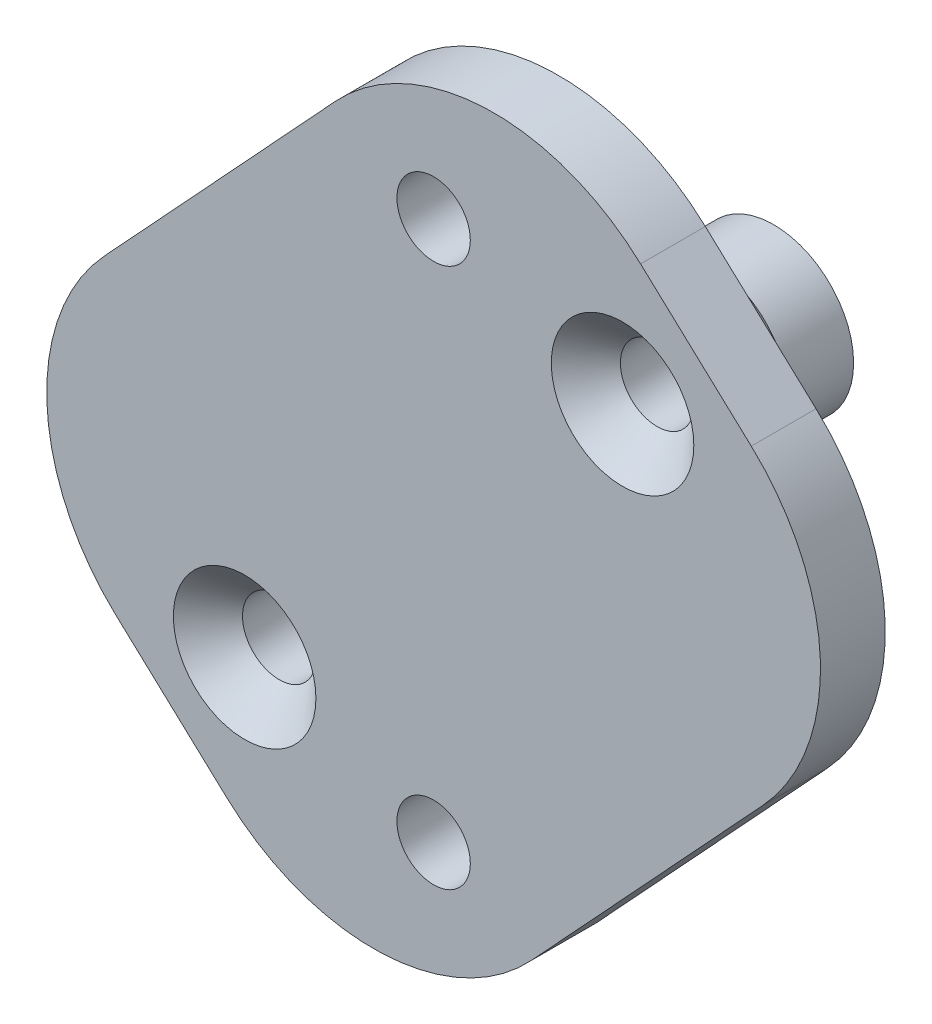
ISO-10303-21;
HEADER;
FILE_DESCRIPTION(('STEP AP214'),'2;1');
FILE_NAME('part.step','',(''),(''),'','','');
FILE_SCHEMA(('AUTOMOTIVE_DESIGN { 1 0 10303 214 1 1 1 1 }'));
ENDSEC;
DATA;
#1=APPLICATION_CONTEXT('core data for automotive mechanical design processes');
#2=APPLICATION_PROTOCOL_DEFINITION('international standard','automotive_design',2000,#1);
#3=PRODUCT_CONTEXT('',#1,'mechanical');
#4=PRODUCT('Part','Part','',(#3));
#5=PRODUCT_RELATED_PRODUCT_CATEGORY('part','',(#4));
#6=PRODUCT_DEFINITION_FORMATION('','',#4);
#7=PRODUCT_DEFINITION_CONTEXT('part definition',#1,'design');
#8=PRODUCT_DEFINITION('design','',#6,#7);
#9=PRODUCT_DEFINITION_SHAPE('','',#8);
#10=(LENGTH_UNIT() NAMED_UNIT(*) SI_UNIT(.MILLI.,.METRE.));
#11=(NAMED_UNIT(*) PLANE_ANGLE_UNIT() SI_UNIT($,.RADIAN.));
#12=(NAMED_UNIT(*) SI_UNIT($,.STERADIAN.) SOLID_ANGLE_UNIT());
#13=UNCERTAINTY_MEASURE_WITH_UNIT(LENGTH_MEASURE(1.E-05),#10,'distance_accuracy_value','');
#14=(GEOMETRIC_REPRESENTATION_CONTEXT(3) GLOBAL_UNCERTAINTY_ASSIGNED_CONTEXT((#13)) GLOBAL_UNIT_ASSIGNED_CONTEXT((#10,
#11,#12)) REPRESENTATION_CONTEXT('',''));
#15=CARTESIAN_POINT('',(0.,0.,0.));
#16=DIRECTION('',(0.,0.,1.));
#17=DIRECTION('',(1.,0.,0.));
#18=AXIS2_PLACEMENT_3D('',#15,#16,#17);
#19=CARTESIAN_POINT('',(0.,0.,1.5));
#20=DIRECTION('',(0.,0.,1.));
#21=DIRECTION('',(1.,0.,0.));
#22=AXIS2_PLACEMENT_3D('',#19,#20,#21);
#23=PLANE('',#22);
#24=CARTESIAN_POINT('',(-8.75,-9.45,1.5));
#25=DIRECTION('',(0.,0.,1.));
#26=DIRECTION('',(1.,0.,0.));
#27=AXIS2_PLACEMENT_3D('',#24,#25,#26);
#28=CIRCLE('',#27,3.3);
#29=CARTESIAN_POINT('',(-5.45,-9.45,1.5));
#30=VERTEX_POINT('',#29);
#31=EDGE_CURVE('E299',#30,#30,#28,.T.);
#32=ORIENTED_EDGE('',*,*,#31,.F.);
#33=EDGE_LOOP('',(#32));
#34=FACE_BOUND('',#33,.T.);
#35=CARTESIAN_POINT('',(8.75,9.45,1.5));
#36=DIRECTION('',(0.,0.,1.));
#37=DIRECTION('',(1.,0.,0.));
#38=AXIS2_PLACEMENT_3D('',#35,#36,#37);
#39=CIRCLE('',#38,3.3);
#40=CARTESIAN_POINT('',(12.05,9.45,1.5));
#41=VERTEX_POINT('',#40);
#42=EDGE_CURVE('E293',#41,#41,#39,.T.);
#43=ORIENTED_EDGE('',*,*,#42,.F.);
#44=EDGE_LOOP('',(#43));
#45=FACE_BOUND('',#44,.T.);
#46=CARTESIAN_POINT('',(0.,12.5,1.5));
#47=DIRECTION('',(0.,0.,1.));
#48=DIRECTION('',(1.,0.,0.));
#49=AXIS2_PLACEMENT_3D('',#46,#47,#48);
#50=CIRCLE('',#49,1.7);
#51=CARTESIAN_POINT('',(1.7,12.5,1.5));
#52=VERTEX_POINT('',#51);
#53=EDGE_CURVE('E263',#52,#52,#50,.T.);
#54=ORIENTED_EDGE('',*,*,#53,.F.);
#55=EDGE_LOOP('',(#54));
#56=FACE_BOUND('',#55,.T.);
#57=DIRECTION('',(0.679408031498305,0.73376067401817,0.));
#58=VECTOR('',#57,1.);
#59=CARTESIAN_POINT('',(-2.24670059833127,-22.2857844433874,1.5));
#60=LINE('',#59,#58);
#61=CARTESIAN_POINT('',(4.54737971665178,-14.9481777032057,1.5));
#62=VERTEX_POINT('',#61);
#63=CARTESIAN_POINT('',(15.2532994016688,-3.38578444338738,1.5));
#64=VERTEX_POINT('',#63);
#65=EDGE_CURVE('E255',#62,#64,#60,.T.);
#66=ORIENTED_EDGE('',*,*,#65,.T.);
#67=CARTESIAN_POINT('',(7.91569266148706,3.40829587159566,1.5));
#68=DIRECTION('',(0.,0.,1.));
#69=DIRECTION('',(1.,0.,0.));
#70=AXIS2_PLACEMENT_3D('',#67,#68,#69);
#71=CIRCLE('',#70,10.);
#72=CARTESIAN_POINT('',(14.7097729764701,10.7459026117774,1.5));
#73=VERTEX_POINT('',#72);
#74=EDGE_CURVE('E162',#64,#73,#71,.T.);
#75=ORIENTED_EDGE('',*,*,#74,.T.);
#76=DIRECTION('',(-0.733760674018169,0.679408031498305,0.));
#77=VECTOR('',#76,1.);
#78=CARTESIAN_POINT('',(2.24670059833126,22.2857844433874,1.5));
#79=LINE('',#78,#77);
#80=CARTESIAN_POINT('',(9.58430733851295,15.4917041284044,1.5));
#81=VERTEX_POINT('',#80);
#82=EDGE_CURVE('E132',#73,#81,#79,.T.);
#83=ORIENTED_EDGE('',*,*,#82,.T.);
#84=CARTESIAN_POINT('',(2.7902270235299,8.15409738822266,1.5));
#85=DIRECTION('',(0.,0.,1.));
#86=DIRECTION('',(1.,0.,0.));
#87=AXIS2_PLACEMENT_3D('',#84,#85,#86);
#88=CIRCLE('',#87,10.);
#89=CARTESIAN_POINT('',(-4.54737971665178,14.9481777032057,1.5));
#90=VERTEX_POINT('',#89);
#91=EDGE_CURVE('E68',#81,#90,#88,.T.);
#92=ORIENTED_EDGE('',*,*,#91,.T.);
#93=DIRECTION('',(-0.679408031498305,-0.733760674018169,0.));
#94=VECTOR('',#93,1.);
#95=CARTESIAN_POINT('',(-22.0473797166518,-3.95182229679431,1.5));
#96=LINE('',#95,#94);
#97=CARTESIAN_POINT('',(-15.2532994016688,3.38578444338738,1.5));
#98=VERTEX_POINT('',#97);
#99=EDGE_CURVE('E148',#90,#98,#96,.T.);
#100=ORIENTED_EDGE('',*,*,#99,.T.);
#101=CARTESIAN_POINT('',(-7.91569266148708,-3.40829587159567,1.5));
#102=DIRECTION('',(0.,0.,1.));
#103=DIRECTION('',(1.,0.,0.));
#104=AXIS2_PLACEMENT_3D('',#101,#102,#103);
#105=CIRCLE('',#104,10.);
#106=CARTESIAN_POINT('',(-14.7097729764701,-10.7459026117774,1.5));
#107=VERTEX_POINT('',#106);
#108=EDGE_CURVE('E159',#98,#107,#105,.T.);
#109=ORIENTED_EDGE('',*,*,#108,.T.);
#110=DIRECTION('',(0.733760674018169,-0.679408031498305,0.));
#111=VECTOR('',#110,1.);
#112=CARTESIAN_POINT('',(-22.0473797166518,-3.95182229679431,1.5));
#113=LINE('',#112,#111);
#114=CARTESIAN_POINT('',(-9.58430733851296,-15.4917041284044,1.5));
#115=VERTEX_POINT('',#114);
#116=EDGE_CURVE('E142',#107,#115,#113,.T.);
#117=ORIENTED_EDGE('',*,*,#116,.T.);
#118=CARTESIAN_POINT('',(-2.79022702352991,-8.15409738822267,1.5));
#119=DIRECTION('',(0.,0.,1.));
#120=DIRECTION('',(1.,0.,0.));
#121=AXIS2_PLACEMENT_3D('',#118,#119,#120);
#122=CIRCLE('',#121,10.);
#123=EDGE_CURVE('E157',#115,#62,#122,.T.);
#124=ORIENTED_EDGE('',*,*,#123,.T.);
#125=EDGE_LOOP('',(#66,#75,#83,#92,#100,#109,#117,#124));
#126=FACE_BOUND('',#125,.T.);
#127=CARTESIAN_POINT('',(0.,-12.5,1.5));
#128=DIRECTION('',(0.,0.,1.));
#129=DIRECTION('',(1.,0.,0.));
#130=AXIS2_PLACEMENT_3D('',#127,#128,#129);
#131=CIRCLE('',#130,1.7);
#132=CARTESIAN_POINT('',(1.7,-12.5,1.5));
#133=VERTEX_POINT('',#132);
#134=EDGE_CURVE('E271',#133,#133,#131,.T.);
#135=ORIENTED_EDGE('',*,*,#134,.F.);
#136=EDGE_LOOP('',(#135));
#137=FACE_BOUND('',#136,.T.);
#138=ADVANCED_FACE('F45',(#34,#45,#56,#126,#137),#23,.T.);
#139=CARTESIAN_POINT('',(0.,0.,-1.5));
#140=DIRECTION('',(0.,0.,1.));
#141=DIRECTION('',(1.,0.,0.));
#142=AXIS2_PLACEMENT_3D('',#139,#140,#141);
#143=PLANE('',#142);
#144=CARTESIAN_POINT('',(8.75,9.45,-1.5));
#145=DIRECTION('',(0.,0.,1.));
#146=DIRECTION('',(1.,0.,0.));
#147=AXIS2_PLACEMENT_3D('',#144,#145,#146);
#148=CIRCLE('',#147,4.70000000000001);
#149=CARTESIAN_POINT('',(13.45,9.45,-1.5));
#150=VERTEX_POINT('',#149);
#151=EDGE_CURVE('E176',#150,#150,#148,.T.);
#152=ORIENTED_EDGE('',*,*,#151,.T.);
#153=EDGE_LOOP('',(#152));
#154=FACE_BOUND('',#153,.T.);
#155=CARTESIAN_POINT('',(-8.75,-9.45,-1.5));
#156=DIRECTION('',(0.,0.,1.));
#157=DIRECTION('',(1.,0.,0.));
#158=AXIS2_PLACEMENT_3D('',#155,#156,#157);
#159=CIRCLE('',#158,4.70000000000001);
#160=CARTESIAN_POINT('',(-4.04999999999999,-9.45,-1.5));
#161=VERTEX_POINT('',#160);
#162=EDGE_CURVE('E173',#161,#161,#159,.T.);
#163=ORIENTED_EDGE('',*,*,#162,.T.);
#164=EDGE_LOOP('',(#163));
#165=FACE_BOUND('',#164,.T.);
#166=DIRECTION('',(-0.733760674018169,0.679408031498305,0.));
#167=VECTOR('',#166,1.);
#168=CARTESIAN_POINT('',(2.24670059833126,22.2857844433874,-1.5));
#169=LINE('',#168,#167);
#170=CARTESIAN_POINT('',(14.7097729764701,10.7459026117774,-1.5));
#171=VERTEX_POINT('',#170);
#172=CARTESIAN_POINT('',(9.58430733851295,15.4917041284044,-1.5));
#173=VERTEX_POINT('',#172);
#174=EDGE_CURVE('E130',#171,#173,#169,.T.);
#175=ORIENTED_EDGE('',*,*,#174,.F.);
#176=CARTESIAN_POINT('',(7.91569266148706,3.40829587159566,-1.5));
#177=DIRECTION('',(0.,0.,1.));
#178=DIRECTION('',(1.,0.,0.));
#179=AXIS2_PLACEMENT_3D('',#176,#177,#178);
#180=CIRCLE('',#179,10.);
#181=CARTESIAN_POINT('',(15.2532994016688,-3.38578444338738,-1.5));
#182=VERTEX_POINT('',#181);
#183=EDGE_CURVE('E113',#171,#182,#180,.F.);
#184=ORIENTED_EDGE('',*,*,#183,.T.);
#185=DIRECTION('',(0.679408031498305,0.73376067401817,0.));
#186=VECTOR('',#185,1.);
#187=CARTESIAN_POINT('',(-2.24670059833127,-22.2857844433874,-1.5));
#188=LINE('',#187,#186);
#189=CARTESIAN_POINT('',(4.54737971665178,-14.9481777032057,-1.5));
#190=VERTEX_POINT('',#189);
#191=EDGE_CURVE('E140',#190,#182,#188,.T.);
#192=ORIENTED_EDGE('',*,*,#191,.F.);
#193=CARTESIAN_POINT('',(-2.79022702352991,-8.15409738822267,-1.5));
#194=DIRECTION('',(0.,0.,1.));
#195=DIRECTION('',(1.,0.,0.));
#196=AXIS2_PLACEMENT_3D('',#193,#194,#195);
#197=CIRCLE('',#196,10.);
#198=CARTESIAN_POINT('',(-9.58430733851296,-15.4917041284044,-1.5));
#199=VERTEX_POINT('',#198);
#200=EDGE_CURVE('E133',#190,#199,#197,.F.);
#201=ORIENTED_EDGE('',*,*,#200,.T.);
#202=DIRECTION('',(0.733760674018169,-0.679408031498305,0.));
#203=VECTOR('',#202,1.);
#204=CARTESIAN_POINT('',(-22.0473797166518,-3.95182229679431,-1.5));
#205=LINE('',#204,#203);
#206=CARTESIAN_POINT('',(-14.7097729764701,-10.7459026117774,-1.5));
#207=VERTEX_POINT('',#206);
#208=EDGE_CURVE('E144',#207,#199,#205,.T.);
#209=ORIENTED_EDGE('',*,*,#208,.F.);
#210=CARTESIAN_POINT('',(-7.91569266148708,-3.40829587159567,-1.5));
#211=DIRECTION('',(0.,0.,1.));
#212=DIRECTION('',(1.,0.,0.));
#213=AXIS2_PLACEMENT_3D('',#210,#211,#212);
#214=CIRCLE('',#213,10.);
#215=CARTESIAN_POINT('',(-15.2532994016688,3.38578444338738,-1.5));
#216=VERTEX_POINT('',#215);
#217=EDGE_CURVE('E151',#207,#216,#214,.F.);
#218=ORIENTED_EDGE('',*,*,#217,.T.);
#219=DIRECTION('',(-0.679408031498305,-0.733760674018169,0.));
#220=VECTOR('',#219,1.);
#221=CARTESIAN_POINT('',(-22.0473797166518,-3.95182229679431,-1.5));
#222=LINE('',#221,#220);
#223=CARTESIAN_POINT('',(-4.54737971665178,14.9481777032057,-1.5));
#224=VERTEX_POINT('',#223);
#225=EDGE_CURVE('E139',#224,#216,#222,.T.);
#226=ORIENTED_EDGE('',*,*,#225,.F.);
#227=CARTESIAN_POINT('',(2.7902270235299,8.15409738822266,-1.5));
#228=DIRECTION('',(0.,0.,1.));
#229=DIRECTION('',(1.,0.,0.));
#230=AXIS2_PLACEMENT_3D('',#227,#228,#229);
#231=CIRCLE('',#230,10.);
#232=EDGE_CURVE('E124',#224,#173,#231,.F.);
#233=ORIENTED_EDGE('',*,*,#232,.T.);
#234=EDGE_LOOP('',(#175,#184,#192,#201,#209,#218,#226,#233));
#235=FACE_BOUND('',#234,.T.);
#236=CARTESIAN_POINT('',(0.,12.5,-1.5));
#237=DIRECTION('',(0.,0.,1.));
#238=DIRECTION('',(1.,0.,0.));
#239=AXIS2_PLACEMENT_3D('',#236,#237,#238);
#240=CIRCLE('',#239,1.7);
#241=CARTESIAN_POINT('',(1.7,12.5,-1.5));
#242=VERTEX_POINT('',#241);
#243=EDGE_CURVE('E266',#242,#242,#240,.T.);
#244=ORIENTED_EDGE('',*,*,#243,.T.);
#245=EDGE_LOOP('',(#244));
#246=FACE_BOUND('',#245,.T.);
#247=CARTESIAN_POINT('',(0.,-12.5,-1.5));
#248=DIRECTION('',(0.,0.,1.));
#249=DIRECTION('',(1.,0.,0.));
#250=AXIS2_PLACEMENT_3D('',#247,#248,#249);
#251=CIRCLE('',#250,1.7);
#252=CARTESIAN_POINT('',(1.7,-12.5,-1.5));
#253=VERTEX_POINT('',#252);
#254=EDGE_CURVE('E273',#253,#253,#251,.T.);
#255=ORIENTED_EDGE('',*,*,#254,.T.);
#256=EDGE_LOOP('',(#255));
#257=FACE_BOUND('',#256,.T.);
#258=ADVANCED_FACE('F136',(#154,#165,#235,#246,#257),#143,.F.);
#259=CARTESIAN_POINT('',(-22.0473797166518,-3.95182229679431,1.5));
#260=DIRECTION('',(0.679408031498305,0.733760674018169,0.));
#261=DIRECTION('',(-0.733760674018169,0.679408031498305,0.));
#262=AXIS2_PLACEMENT_3D('',#259,#260,#261);
#263=PLANE('',#262);
#264=ORIENTED_EDGE('',*,*,#116,.F.);
#265=DIRECTION('',(0.,0.,-1.));
#266=VECTOR('',#265,1.);
#267=CARTESIAN_POINT('',(-14.7097729764701,-10.7459026117774,1.5));
#268=LINE('',#267,#266);
#269=EDGE_CURVE('E170',#107,#207,#268,.T.);
#270=ORIENTED_EDGE('',*,*,#269,.T.);
#271=ORIENTED_EDGE('',*,*,#208,.T.);
#272=DIRECTION('',(0.,0.,-1.));
#273=VECTOR('',#272,1.);
#274=CARTESIAN_POINT('',(-9.58430733851296,-15.4917041284044,1.5));
#275=LINE('',#274,#273);
#276=EDGE_CURVE('E168',#199,#115,#275,.F.);
#277=ORIENTED_EDGE('',*,*,#276,.T.);
#278=EDGE_LOOP('',(#264,#270,#271,#277));
#279=FACE_BOUND('',#278,.T.);
#280=ADVANCED_FACE('F192',(#279),#263,.F.);
#281=CARTESIAN_POINT('',(-2.24670059833127,-22.2857844433874,1.5));
#282=DIRECTION('',(-0.733760674018169,0.679408031498305,0.));
#283=DIRECTION('',(-0.679408031498305,-0.73376067401817,0.));
#284=AXIS2_PLACEMENT_3D('',#281,#282,#283);
#285=PLANE('',#284);
#286=ORIENTED_EDGE('',*,*,#191,.T.);
#287=DIRECTION('',(0.,0.,-1.));
#288=VECTOR('',#287,1.);
#289=CARTESIAN_POINT('',(15.2532994016688,-3.38578444338738,1.5));
#290=LINE('',#289,#288);
#291=EDGE_CURVE('E118',#182,#64,#290,.F.);
#292=ORIENTED_EDGE('',*,*,#291,.T.);
#293=ORIENTED_EDGE('',*,*,#65,.F.);
#294=DIRECTION('',(0.,0.,-1.));
#295=VECTOR('',#294,1.);
#296=CARTESIAN_POINT('',(4.54737971665178,-14.9481777032057,1.5));
#297=LINE('',#296,#295);
#298=EDGE_CURVE('E123',#62,#190,#297,.T.);
#299=ORIENTED_EDGE('',*,*,#298,.T.);
#300=EDGE_LOOP('',(#286,#292,#293,#299));
#301=FACE_BOUND('',#300,.T.);
#302=ADVANCED_FACE('F217',(#301),#285,.F.);
#303=CARTESIAN_POINT('',(2.24670059833126,22.2857844433874,1.5));
#304=DIRECTION('',(-0.679408031498305,-0.733760674018169,0.));
#305=DIRECTION('',(0.733760674018169,-0.679408031498305,0.));
#306=AXIS2_PLACEMENT_3D('',#303,#304,#305);
#307=PLANE('',#306);
#308=ORIENTED_EDGE('',*,*,#82,.F.);
#309=DIRECTION('',(0.,0.,-1.));
#310=VECTOR('',#309,1.);
#311=CARTESIAN_POINT('',(14.7097729764701,10.7459026117774,1.5));
#312=LINE('',#311,#310);
#313=EDGE_CURVE('E117',#73,#171,#312,.T.);
#314=ORIENTED_EDGE('',*,*,#313,.T.);
#315=ORIENTED_EDGE('',*,*,#174,.T.);
#316=DIRECTION('',(0.,0.,-1.));
#317=VECTOR('',#316,1.);
#318=CARTESIAN_POINT('',(9.58430733851295,15.4917041284044,1.5));
#319=LINE('',#318,#317);
#320=EDGE_CURVE('E134',#173,#81,#319,.F.);
#321=ORIENTED_EDGE('',*,*,#320,.T.);
#322=EDGE_LOOP('',(#308,#314,#315,#321));
#323=FACE_BOUND('',#322,.T.);
#324=ADVANCED_FACE('F129',(#323),#307,.F.);
#325=CARTESIAN_POINT('',(-22.0473797166518,-3.95182229679431,1.5));
#326=DIRECTION('',(0.733760674018169,-0.679408031498305,0.));
#327=DIRECTION('',(0.679408031498305,0.733760674018169,0.));
#328=AXIS2_PLACEMENT_3D('',#325,#326,#327);
#329=PLANE('',#328);
#330=ORIENTED_EDGE('',*,*,#99,.F.);
#331=DIRECTION('',(0.,0.,-1.));
#332=VECTOR('',#331,1.);
#333=CARTESIAN_POINT('',(-4.54737971665178,14.9481777032057,1.5));
#334=LINE('',#333,#332);
#335=EDGE_CURVE('E165',#90,#224,#334,.T.);
#336=ORIENTED_EDGE('',*,*,#335,.T.);
#337=ORIENTED_EDGE('',*,*,#225,.T.);
#338=DIRECTION('',(0.,0.,-1.));
#339=VECTOR('',#338,1.);
#340=CARTESIAN_POINT('',(-15.2532994016688,3.38578444338738,1.5));
#341=LINE('',#340,#339);
#342=EDGE_CURVE('E61',#216,#98,#341,.F.);
#343=ORIENTED_EDGE('',*,*,#342,.T.);
#344=EDGE_LOOP('',(#330,#336,#337,#343));
#345=FACE_BOUND('',#344,.T.);
#346=ADVANCED_FACE('F212',(#345),#329,.F.);
#347=CARTESIAN_POINT('',(-8.75,-9.45,1.5));
#348=DIRECTION('',(0.,0.,-1.));
#349=DIRECTION('',(-1.,0.,0.));
#350=AXIS2_PLACEMENT_3D('',#347,#348,#349);
#351=CYLINDRICAL_SURFACE('',#350,1.7);
#352=CARTESIAN_POINT('',(-8.75,-9.45,-0.0999999999999942));
#353=DIRECTION('',(0.,0.,1.));
#354=DIRECTION('',(1.,0.,0.));
#355=AXIS2_PLACEMENT_3D('',#352,#353,#354);
#356=CIRCLE('',#355,1.7);
#357=CARTESIAN_POINT('',(-7.05,-9.45,-0.0999999999999942));
#358=VERTEX_POINT('',#357);
#359=EDGE_CURVE('E296',#358,#358,#356,.F.);
#360=ORIENTED_EDGE('',*,*,#359,.F.);
#361=EDGE_LOOP('',(#360));
#362=FACE_BOUND('',#361,.T.);
#363=CARTESIAN_POINT('',(-8.75,-9.45,-5.5));
#364=DIRECTION('',(0.,0.,1.));
#365=DIRECTION('',(1.,0.,0.));
#366=AXIS2_PLACEMENT_3D('',#363,#364,#365);
#367=CIRCLE('',#366,1.7);
#368=CARTESIAN_POINT('',(-7.05,-9.45,-5.5));
#369=VERTEX_POINT('',#368);
#370=EDGE_CURVE('E284',#369,#369,#367,.T.);
#371=ORIENTED_EDGE('',*,*,#370,.F.);
#372=EDGE_LOOP('',(#371));
#373=FACE_BOUND('',#372,.T.);
#374=ADVANCED_FACE('F209',(#362,#373),#351,.F.);
#375=CARTESIAN_POINT('',(8.75,9.45,1.5));
#376=DIRECTION('',(0.,0.,-1.));
#377=DIRECTION('',(-1.,0.,0.));
#378=AXIS2_PLACEMENT_3D('',#375,#376,#377);
#379=CYLINDRICAL_SURFACE('',#378,1.7);
#380=CARTESIAN_POINT('',(8.75,9.45,-0.0999999999999959));
#381=DIRECTION('',(0.,0.,1.));
#382=DIRECTION('',(1.,0.,0.));
#383=AXIS2_PLACEMENT_3D('',#380,#381,#382);
#384=CIRCLE('',#383,1.7);
#385=CARTESIAN_POINT('',(10.45,9.45,-0.0999999999999959));
#386=VERTEX_POINT('',#385);
#387=EDGE_CURVE('E290',#386,#386,#384,.F.);
#388=ORIENTED_EDGE('',*,*,#387,.F.);
#389=EDGE_LOOP('',(#388));
#390=FACE_BOUND('',#389,.T.);
#391=CARTESIAN_POINT('',(8.75,9.45,-5.5));
#392=DIRECTION('',(0.,0.,1.));
#393=DIRECTION('',(1.,0.,0.));
#394=AXIS2_PLACEMENT_3D('',#391,#392,#393);
#395=CIRCLE('',#394,1.7);
#396=CARTESIAN_POINT('',(10.45,9.45,-5.5));
#397=VERTEX_POINT('',#396);
#398=EDGE_CURVE('E281',#397,#397,#395,.T.);
#399=ORIENTED_EDGE('',*,*,#398,.F.);
#400=EDGE_LOOP('',(#399));
#401=FACE_BOUND('',#400,.T.);
#402=ADVANCED_FACE('F328',(#390,#401),#379,.F.);
#403=CARTESIAN_POINT('',(0.,12.5,1.5));
#404=DIRECTION('',(0.,0.,-1.));
#405=DIRECTION('',(-1.,0.,0.));
#406=AXIS2_PLACEMENT_3D('',#403,#404,#405);
#407=CYLINDRICAL_SURFACE('',#406,1.7);
#408=ORIENTED_EDGE('',*,*,#53,.T.);
#409=EDGE_LOOP('',(#408));
#410=FACE_BOUND('',#409,.T.);
#411=ORIENTED_EDGE('',*,*,#243,.F.);
#412=EDGE_LOOP('',(#411));
#413=FACE_BOUND('',#412,.T.);
#414=ADVANCED_FACE('F325',(#410,#413),#407,.F.);
#415=CARTESIAN_POINT('',(0.,-12.5,1.5));
#416=DIRECTION('',(0.,0.,-1.));
#417=DIRECTION('',(-1.,0.,0.));
#418=AXIS2_PLACEMENT_3D('',#415,#416,#417);
#419=CYLINDRICAL_SURFACE('',#418,1.7);
#420=ORIENTED_EDGE('',*,*,#134,.T.);
#421=EDGE_LOOP('',(#420));
#422=FACE_BOUND('',#421,.T.);
#423=ORIENTED_EDGE('',*,*,#254,.F.);
#424=EDGE_LOOP('',(#423));
#425=FACE_BOUND('',#424,.T.);
#426=ADVANCED_FACE('F227',(#422,#425),#419,.F.);
#427=CARTESIAN_POINT('',(7.91569266148706,3.40829587159566,1.5));
#428=DIRECTION('',(0.,0.,-1.));
#429=DIRECTION('',(-1.,0.,0.));
#430=AXIS2_PLACEMENT_3D('',#427,#428,#429);
#431=CYLINDRICAL_SURFACE('',#430,10.);
#432=ORIENTED_EDGE('',*,*,#74,.F.);
#433=ORIENTED_EDGE('',*,*,#291,.F.);
#434=ORIENTED_EDGE('',*,*,#183,.F.);
#435=ORIENTED_EDGE('',*,*,#313,.F.);
#436=EDGE_LOOP('',(#432,#433,#434,#435));
#437=FACE_BOUND('',#436,.T.);
#438=ADVANCED_FACE('F116',(#437),#431,.T.);
#439=CARTESIAN_POINT('',(2.7902270235299,8.15409738822266,1.5));
#440=DIRECTION('',(0.,0.,-1.));
#441=DIRECTION('',(-1.,0.,0.));
#442=AXIS2_PLACEMENT_3D('',#439,#440,#441);
#443=CYLINDRICAL_SURFACE('',#442,10.);
#444=ORIENTED_EDGE('',*,*,#91,.F.);
#445=ORIENTED_EDGE('',*,*,#320,.F.);
#446=ORIENTED_EDGE('',*,*,#232,.F.);
#447=ORIENTED_EDGE('',*,*,#335,.F.);
#448=EDGE_LOOP('',(#444,#445,#446,#447));
#449=FACE_BOUND('',#448,.T.);
#450=ADVANCED_FACE('F226',(#449),#443,.T.);
#451=CARTESIAN_POINT('',(-7.91569266148708,-3.40829587159567,1.5));
#452=DIRECTION('',(0.,0.,-1.));
#453=DIRECTION('',(-1.,0.,0.));
#454=AXIS2_PLACEMENT_3D('',#451,#452,#453);
#455=CYLINDRICAL_SURFACE('',#454,10.);
#456=ORIENTED_EDGE('',*,*,#108,.F.);
#457=ORIENTED_EDGE('',*,*,#342,.F.);
#458=ORIENTED_EDGE('',*,*,#217,.F.);
#459=ORIENTED_EDGE('',*,*,#269,.F.);
#460=EDGE_LOOP('',(#456,#457,#458,#459));
#461=FACE_BOUND('',#460,.T.);
#462=ADVANCED_FACE('F230',(#461),#455,.T.);
#463=CARTESIAN_POINT('',(-2.79022702352991,-8.15409738822267,1.5));
#464=DIRECTION('',(0.,0.,-1.));
#465=DIRECTION('',(-1.,0.,0.));
#466=AXIS2_PLACEMENT_3D('',#463,#464,#465);
#467=CYLINDRICAL_SURFACE('',#466,10.);
#468=ORIENTED_EDGE('',*,*,#123,.F.);
#469=ORIENTED_EDGE('',*,*,#276,.F.);
#470=ORIENTED_EDGE('',*,*,#200,.F.);
#471=ORIENTED_EDGE('',*,*,#298,.F.);
#472=EDGE_LOOP('',(#468,#469,#470,#471));
#473=FACE_BOUND('',#472,.T.);
#474=ADVANCED_FACE('F234',(#473),#467,.T.);
#475=CARTESIAN_POINT('',(8.75,9.45,-5.5));
#476=DIRECTION('',(0.,0.,1.));
#477=DIRECTION('',(1.,0.,0.));
#478=AXIS2_PLACEMENT_3D('',#475,#476,#477);
#479=CYLINDRICAL_SURFACE('',#478,3.7);
#480=CARTESIAN_POINT('',(8.75,9.45,-2.5));
#481=DIRECTION('',(0.,0.,1.));
#482=DIRECTION('',(1.,0.,0.));
#483=AXIS2_PLACEMENT_3D('',#480,#481,#482);
#484=CIRCLE('',#483,3.7);
#485=CARTESIAN_POINT('',(12.45,9.45,-2.5));
#486=VERTEX_POINT('',#485);
#487=EDGE_CURVE('E54',#486,#486,#484,.F.);
#488=ORIENTED_EDGE('',*,*,#487,.T.);
#489=EDGE_LOOP('',(#488));
#490=FACE_BOUND('',#489,.T.);
#491=CARTESIAN_POINT('',(8.75,9.45,-5.5));
#492=DIRECTION('',(0.,0.,1.));
#493=DIRECTION('',(1.,0.,0.));
#494=AXIS2_PLACEMENT_3D('',#491,#492,#493);
#495=CIRCLE('',#494,3.7);
#496=CARTESIAN_POINT('',(12.45,9.45,-5.5));
#497=VERTEX_POINT('',#496);
#498=EDGE_CURVE('E276',#497,#497,#495,.T.);
#499=ORIENTED_EDGE('',*,*,#498,.T.);
#500=EDGE_LOOP('',(#499));
#501=FACE_BOUND('',#500,.T.);
#502=ADVANCED_FACE('F181',(#490,#501),#479,.T.);
#503=CARTESIAN_POINT('',(8.75,9.45,-5.5));
#504=DIRECTION('',(0.,0.,1.));
#505=DIRECTION('',(1.,0.,0.));
#506=AXIS2_PLACEMENT_3D('',#503,#504,#505);
#507=PLANE('',#506);
#508=ORIENTED_EDGE('',*,*,#398,.T.);
#509=EDGE_LOOP('',(#508));
#510=FACE_BOUND('',#509,.T.);
#511=ORIENTED_EDGE('',*,*,#498,.F.);
#512=EDGE_LOOP('',(#511));
#513=FACE_BOUND('',#512,.T.);
#514=ADVANCED_FACE('F246',(#510,#513),#507,.F.);
#515=CARTESIAN_POINT('',(-8.75,-9.45,-5.5));
#516=DIRECTION('',(0.,0.,1.));
#517=DIRECTION('',(1.,0.,0.));
#518=AXIS2_PLACEMENT_3D('',#515,#516,#517);
#519=CYLINDRICAL_SURFACE('',#518,3.7);
#520=CARTESIAN_POINT('',(-8.75,-9.45,-2.5));
#521=DIRECTION('',(0.,0.,1.));
#522=DIRECTION('',(1.,0.,0.));
#523=AXIS2_PLACEMENT_3D('',#520,#521,#522);
#524=CIRCLE('',#523,3.7);
#525=CARTESIAN_POINT('',(-5.05,-9.45,-2.5));
#526=VERTEX_POINT('',#525);
#527=EDGE_CURVE('E11',#526,#526,#524,.F.);
#528=ORIENTED_EDGE('',*,*,#527,.T.);
#529=EDGE_LOOP('',(#528));
#530=FACE_BOUND('',#529,.T.);
#531=CARTESIAN_POINT('',(-8.75,-9.45,-5.5));
#532=DIRECTION('',(0.,0.,1.));
#533=DIRECTION('',(1.,0.,0.));
#534=AXIS2_PLACEMENT_3D('',#531,#532,#533);
#535=CIRCLE('',#534,3.7);
#536=CARTESIAN_POINT('',(-5.05,-9.45,-5.5));
#537=VERTEX_POINT('',#536);
#538=EDGE_CURVE('E287',#537,#537,#535,.T.);
#539=ORIENTED_EDGE('',*,*,#538,.T.);
#540=EDGE_LOOP('',(#539));
#541=FACE_BOUND('',#540,.T.);
#542=ADVANCED_FACE('F313',(#530,#541),#519,.T.);
#543=CARTESIAN_POINT('',(-8.75,-9.45,-5.5));
#544=DIRECTION('',(0.,0.,1.));
#545=DIRECTION('',(1.,0.,0.));
#546=AXIS2_PLACEMENT_3D('',#543,#544,#545);
#547=PLANE('',#546);
#548=ORIENTED_EDGE('',*,*,#370,.T.);
#549=EDGE_LOOP('',(#548));
#550=FACE_BOUND('',#549,.T.);
#551=ORIENTED_EDGE('',*,*,#538,.F.);
#552=EDGE_LOOP('',(#551));
#553=FACE_BOUND('',#552,.T.);
#554=ADVANCED_FACE('F309',(#550,#553),#547,.F.);
#555=CARTESIAN_POINT('',(8.75,9.45,1.5));
#556=DIRECTION('',(0.,0.,1.));
#557=DIRECTION('',(1.,0.,0.));
#558=AXIS2_PLACEMENT_3D('',#555,#556,#557);
#559=CONICAL_SURFACE('',#558,3.3,0.78539816339745);
#560=ORIENTED_EDGE('',*,*,#387,.T.);
#561=EDGE_LOOP('',(#560));
#562=FACE_BOUND('',#561,.T.);
#563=ORIENTED_EDGE('',*,*,#42,.T.);
#564=EDGE_LOOP('',(#563));
#565=FACE_BOUND('',#564,.T.);
#566=ADVANCED_FACE('F303',(#562,#565),#559,.F.);
#567=CARTESIAN_POINT('',(-8.75,-9.45,1.5));
#568=DIRECTION('',(0.,0.,1.));
#569=DIRECTION('',(1.,0.,0.));
#570=AXIS2_PLACEMENT_3D('',#567,#568,#569);
#571=CONICAL_SURFACE('',#570,3.3,0.78539816339745);
#572=ORIENTED_EDGE('',*,*,#359,.T.);
#573=EDGE_LOOP('',(#572));
#574=FACE_BOUND('',#573,.T.);
#575=ORIENTED_EDGE('',*,*,#31,.T.);
#576=EDGE_LOOP('',(#575));
#577=FACE_BOUND('',#576,.T.);
#578=ADVANCED_FACE('F187',(#574,#577),#571,.F.);
#579=CARTESIAN_POINT('',(8.75,9.45,-1.5));
#580=DIRECTION('',(0.,0.,1.));
#581=DIRECTION('',(1.,0.,0.));
#582=AXIS2_PLACEMENT_3D('',#579,#580,#581);
#583=CONICAL_SURFACE('',#582,4.70000000000001,0.785398163397453);
#584=ORIENTED_EDGE('',*,*,#487,.F.);
#585=EDGE_LOOP('',(#584));
#586=FACE_BOUND('',#585,.T.);
#587=ORIENTED_EDGE('',*,*,#151,.F.);
#588=EDGE_LOOP('',(#587));
#589=FACE_BOUND('',#588,.T.);
#590=ADVANCED_FACE('F184',(#586,#589),#583,.T.);
#591=CARTESIAN_POINT('',(-8.75,-9.45,-1.5));
#592=DIRECTION('',(0.,0.,1.));
#593=DIRECTION('',(1.,0.,0.));
#594=AXIS2_PLACEMENT_3D('',#591,#592,#593);
#595=CONICAL_SURFACE('',#594,4.70000000000001,0.785398163397453);
#596=ORIENTED_EDGE('',*,*,#527,.F.);
#597=EDGE_LOOP('',(#596));
#598=FACE_BOUND('',#597,.T.);
#599=ORIENTED_EDGE('',*,*,#162,.F.);
#600=EDGE_LOOP('',(#599));
#601=FACE_BOUND('',#600,.T.);
#602=ADVANCED_FACE('F48',(#598,#601),#595,.T.);
#603=CLOSED_SHELL('',(#138,#258,#280,#302,#324,#346,#374,#402,#414,#426,#438,#450,#462,#474,
#502,#514,#542,#554,#566,#578,#590,#602));
#604=MANIFOLD_SOLID_BREP('B2',#603);
#605=ADVANCED_BREP_SHAPE_REPRESENTATION('',(#18,#604),#14);
#606=SHAPE_DEFINITION_REPRESENTATION(#9,#605);
ENDSEC;
END-ISO-10303-21;
